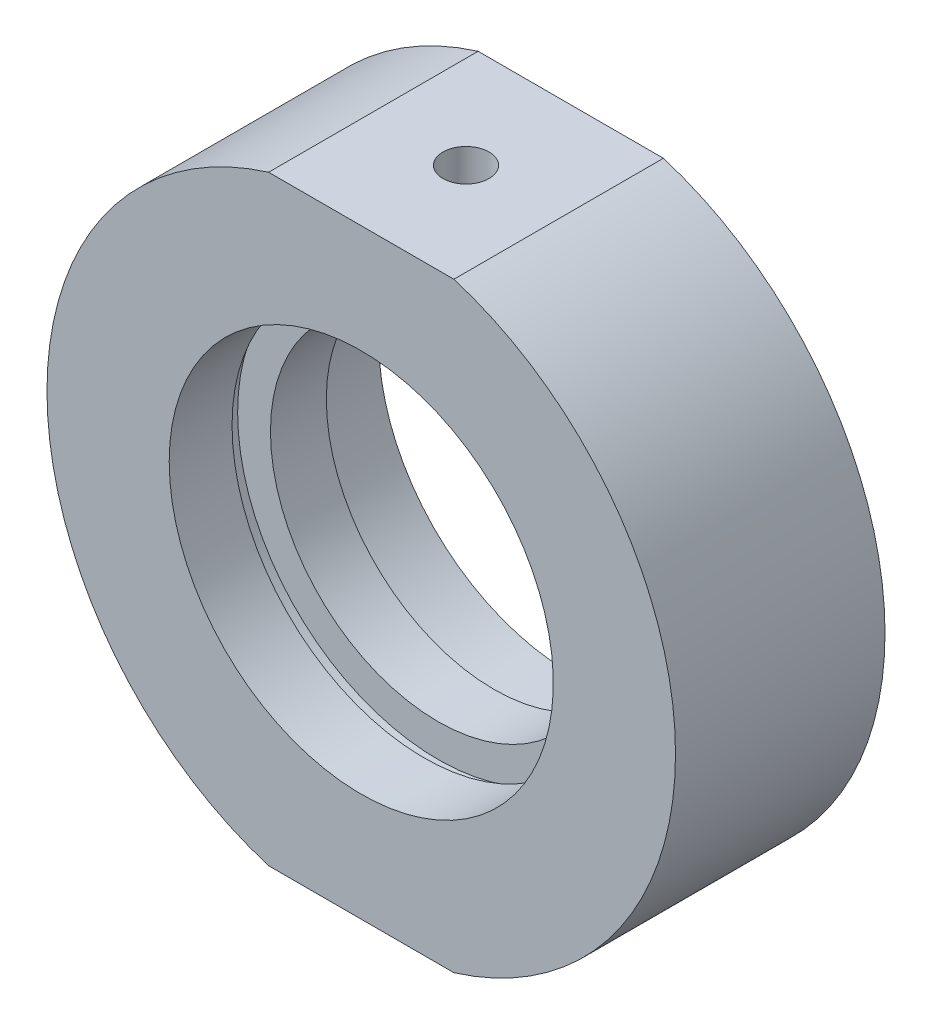
ISO-10303-21;
HEADER;
FILE_DESCRIPTION(('STEP AP214'),'2;1');
FILE_NAME('part.step','',(''),(''),'','','');
FILE_SCHEMA(('AUTOMOTIVE_DESIGN { 1 0 10303 214 1 1 1 1 }'));
ENDSEC;
DATA;
#1=APPLICATION_CONTEXT('core data for automotive mechanical design processes');
#2=APPLICATION_PROTOCOL_DEFINITION('international standard','automotive_design',2000,#1);
#3=PRODUCT_CONTEXT('',#1,'mechanical');
#4=PRODUCT('Part','Part','',(#3));
#5=PRODUCT_RELATED_PRODUCT_CATEGORY('part','',(#4));
#6=PRODUCT_DEFINITION_FORMATION('','',#4);
#7=PRODUCT_DEFINITION_CONTEXT('part definition',#1,'design');
#8=PRODUCT_DEFINITION('design','',#6,#7);
#9=PRODUCT_DEFINITION_SHAPE('','',#8);
#10=(LENGTH_UNIT() NAMED_UNIT(*) SI_UNIT(.MILLI.,.METRE.));
#11=(NAMED_UNIT(*) PLANE_ANGLE_UNIT() SI_UNIT($,.RADIAN.));
#12=(NAMED_UNIT(*) SI_UNIT($,.STERADIAN.) SOLID_ANGLE_UNIT());
#13=UNCERTAINTY_MEASURE_WITH_UNIT(LENGTH_MEASURE(1.E-05),#10,'distance_accuracy_value','');
#14=(GEOMETRIC_REPRESENTATION_CONTEXT(3) GLOBAL_UNCERTAINTY_ASSIGNED_CONTEXT((#13)) GLOBAL_UNIT_ASSIGNED_CONTEXT((#10,
#11,#12)) REPRESENTATION_CONTEXT('',''));
#15=CARTESIAN_POINT('',(0.,0.,0.));
#16=DIRECTION('',(0.,0.,1.));
#17=DIRECTION('',(1.,0.,0.));
#18=AXIS2_PLACEMENT_3D('',#15,#16,#17);
#19=CARTESIAN_POINT('',(0.,0.,-31.9390681003584));
#20=DIRECTION('',(0.,0.,-1.));
#21=DIRECTION('',(-1.,0.,0.));
#22=AXIS2_PLACEMENT_3D('',#19,#20,#21);
#23=CYLINDRICAL_SURFACE('',#22,22.5);
#24=CARTESIAN_POINT('',(0.,0.,7.49999999999999));
#25=DIRECTION('',(0.,0.,-1.));
#26=DIRECTION('',(-1.,0.,0.));
#27=AXIS2_PLACEMENT_3D('',#24,#25,#26);
#28=CIRCLE('',#27,22.5);
#29=CARTESIAN_POINT('',(6.63324958071081,21.5,7.5));
#30=VERTEX_POINT('',#29);
#31=CARTESIAN_POINT('',(6.63324958071081,-21.5,7.5));
#32=VERTEX_POINT('',#31);
#33=EDGE_CURVE('E132',#30,#32,#28,.T.);
#34=ORIENTED_EDGE('',*,*,#33,.T.);
#35=DIRECTION('',(0.,0.,-1.));
#36=VECTOR('',#35,1.);
#37=CARTESIAN_POINT('',(6.63324958071083,-21.5,-31.9390681003584));
#38=LINE('',#37,#36);
#39=CARTESIAN_POINT('',(6.6332495807108,-21.5,-7.5));
#40=VERTEX_POINT('',#39);
#41=EDGE_CURVE('E106',#32,#40,#38,.T.);
#42=ORIENTED_EDGE('',*,*,#41,.T.);
#43=CARTESIAN_POINT('',(0.,0.,-7.5));
#44=DIRECTION('',(0.,0.,-1.));
#45=DIRECTION('',(-1.,0.,0.));
#46=AXIS2_PLACEMENT_3D('',#43,#44,#45);
#47=CIRCLE('',#46,22.5);
#48=CARTESIAN_POINT('',(6.6332495807108,21.5,-7.5));
#49=VERTEX_POINT('',#48);
#50=EDGE_CURVE('E128',#49,#40,#47,.T.);
#51=ORIENTED_EDGE('',*,*,#50,.F.);
#52=DIRECTION('',(0.,0.,-1.));
#53=VECTOR('',#52,1.);
#54=CARTESIAN_POINT('',(6.63324958071083,21.5,-31.9390681003584));
#55=LINE('',#54,#53);
#56=EDGE_CURVE('E59',#49,#30,#55,.F.);
#57=ORIENTED_EDGE('',*,*,#56,.T.);
#58=EDGE_LOOP('',(#34,#42,#51,#57));
#59=FACE_BOUND('',#58,.T.);
#60=ADVANCED_FACE('F37',(#59),#23,.T.);
#61=CARTESIAN_POINT('',(12.,0.,-2.));
#62=DIRECTION('',(0.,0.,1.));
#63=DIRECTION('',(1.,0.,0.));
#64=AXIS2_PLACEMENT_3D('',#61,#62,#63);
#65=PLANE('',#64);
#66=CARTESIAN_POINT('',(0.,0.,-2.00000000000001));
#67=DIRECTION('',(0.,0.,-1.));
#68=DIRECTION('',(-1.,0.,0.));
#69=AXIS2_PLACEMENT_3D('',#66,#67,#68);
#70=CIRCLE('',#69,12.);
#71=CARTESIAN_POINT('',(-12.,0.,-2.));
#72=VERTEX_POINT('',#71);
#73=EDGE_CURVE('E150',#72,#72,#70,.T.);
#74=ORIENTED_EDGE('',*,*,#73,.F.);
#75=EDGE_LOOP('',(#74));
#76=FACE_BOUND('',#75,.T.);
#77=CARTESIAN_POINT('',(0.,0.,-2.));
#78=DIRECTION('',(0.,0.,-1.));
#79=DIRECTION('',(-1.,0.,0.));
#80=AXIS2_PLACEMENT_3D('',#77,#78,#79);
#81=CIRCLE('',#80,14.35);
#82=CARTESIAN_POINT('',(-14.35,0.,-2.));
#83=VERTEX_POINT('',#82);
#84=EDGE_CURVE('E115',#83,#83,#81,.T.);
#85=ORIENTED_EDGE('',*,*,#84,.T.);
#86=EDGE_LOOP('',(#85));
#87=FACE_BOUND('',#86,.T.);
#88=ADVANCED_FACE('F39',(#76,#87),#65,.F.);
#89=CARTESIAN_POINT('',(0.,0.,-31.9390681003584));
#90=DIRECTION('',(0.,0.,-1.));
#91=DIRECTION('',(-1.,0.,0.));
#92=AXIS2_PLACEMENT_3D('',#89,#90,#91);
#93=CYLINDRICAL_SURFACE('',#92,12.);
#94=CARTESIAN_POINT('',(0.,0.,1.99999999999999));
#95=DIRECTION('',(0.,0.,-1.));
#96=DIRECTION('',(-1.,0.,0.));
#97=AXIS2_PLACEMENT_3D('',#94,#95,#96);
#98=CIRCLE('',#97,12.);
#99=CARTESIAN_POINT('',(-12.,0.,2.));
#100=VERTEX_POINT('',#99);
#101=EDGE_CURVE('E147',#100,#100,#98,.T.);
#102=ORIENTED_EDGE('',*,*,#101,.F.);
#103=EDGE_LOOP('',(#102));
#104=FACE_BOUND('',#103,.T.);
#105=ORIENTED_EDGE('',*,*,#73,.T.);
#106=EDGE_LOOP('',(#105));
#107=FACE_BOUND('',#106,.T.);
#108=ADVANCED_FACE('F189',(#104,#107),#93,.F.);
#109=CARTESIAN_POINT('',(14.35,0.,2.));
#110=DIRECTION('',(0.,0.,-1.));
#111=DIRECTION('',(-1.,0.,0.));
#112=AXIS2_PLACEMENT_3D('',#109,#110,#111);
#113=PLANE('',#112);
#114=CARTESIAN_POINT('',(0.,0.,1.99999999999999));
#115=DIRECTION('',(0.,0.,-1.));
#116=DIRECTION('',(-1.,0.,0.));
#117=AXIS2_PLACEMENT_3D('',#114,#115,#116);
#118=CIRCLE('',#117,14.35);
#119=CARTESIAN_POINT('',(-14.35,0.,2.));
#120=VERTEX_POINT('',#119);
#121=EDGE_CURVE('E144',#120,#120,#118,.T.);
#122=ORIENTED_EDGE('',*,*,#121,.F.);
#123=EDGE_LOOP('',(#122));
#124=FACE_BOUND('',#123,.T.);
#125=ORIENTED_EDGE('',*,*,#101,.T.);
#126=EDGE_LOOP('',(#125));
#127=FACE_BOUND('',#126,.T.);
#128=ADVANCED_FACE('F214',(#124,#127),#113,.F.);
#129=CARTESIAN_POINT('',(0.,0.,-31.9390681003584));
#130=DIRECTION('',(0.,0.,-1.));
#131=DIRECTION('',(-1.,0.,0.));
#132=AXIS2_PLACEMENT_3D('',#129,#130,#131);
#133=CYLINDRICAL_SURFACE('',#132,14.35);
#134=CARTESIAN_POINT('',(0.,0.,3.));
#135=DIRECTION('',(0.,0.,-1.));
#136=DIRECTION('',(-1.,0.,0.));
#137=AXIS2_PLACEMENT_3D('',#134,#135,#136);
#138=CIRCLE('',#137,14.35);
#139=CARTESIAN_POINT('',(-14.35,0.,3.));
#140=VERTEX_POINT('',#139);
#141=EDGE_CURVE('E141',#140,#140,#138,.T.);
#142=ORIENTED_EDGE('',*,*,#141,.F.);
#143=EDGE_LOOP('',(#142));
#144=FACE_BOUND('',#143,.T.);
#145=ORIENTED_EDGE('',*,*,#121,.T.);
#146=EDGE_LOOP('',(#145));
#147=FACE_BOUND('',#146,.T.);
#148=ADVANCED_FACE('F210',(#144,#147),#133,.F.);
#149=CARTESIAN_POINT('',(14.35,0.,3.));
#150=DIRECTION('',(0.,0.,1.));
#151=DIRECTION('',(1.,0.,0.));
#152=AXIS2_PLACEMENT_3D('',#149,#150,#151);
#153=PLANE('',#152);
#154=CARTESIAN_POINT('',(0.,0.,3.));
#155=DIRECTION('',(0.,0.,-1.));
#156=DIRECTION('',(-1.,0.,0.));
#157=AXIS2_PLACEMENT_3D('',#154,#155,#156);
#158=CIRCLE('',#157,13.75);
#159=CARTESIAN_POINT('',(-13.75,0.,3.));
#160=VERTEX_POINT('',#159);
#161=EDGE_CURVE('E138',#160,#160,#158,.T.);
#162=ORIENTED_EDGE('',*,*,#161,.F.);
#163=EDGE_LOOP('',(#162));
#164=FACE_BOUND('',#163,.T.);
#165=ORIENTED_EDGE('',*,*,#141,.T.);
#166=EDGE_LOOP('',(#165));
#167=FACE_BOUND('',#166,.T.);
#168=ADVANCED_FACE('F204',(#164,#167),#153,.F.);
#169=CARTESIAN_POINT('',(0.,0.,-31.9390681003584));
#170=DIRECTION('',(0.,0.,-1.));
#171=DIRECTION('',(-1.,0.,0.));
#172=AXIS2_PLACEMENT_3D('',#169,#170,#171);
#173=CYLINDRICAL_SURFACE('',#172,13.75);
#174=CARTESIAN_POINT('',(0.,0.,7.5));
#175=DIRECTION('',(0.,0.,-1.));
#176=DIRECTION('',(-1.,0.,0.));
#177=AXIS2_PLACEMENT_3D('',#174,#175,#176);
#178=CIRCLE('',#177,13.75);
#179=CARTESIAN_POINT('',(-13.75,0.,7.5));
#180=VERTEX_POINT('',#179);
#181=EDGE_CURVE('E135',#180,#180,#178,.T.);
#182=ORIENTED_EDGE('',*,*,#181,.F.);
#183=EDGE_LOOP('',(#182));
#184=FACE_BOUND('',#183,.T.);
#185=ORIENTED_EDGE('',*,*,#161,.T.);
#186=EDGE_LOOP('',(#185));
#187=FACE_BOUND('',#186,.T.);
#188=ADVANCED_FACE('F200',(#184,#187),#173,.F.);
#189=CARTESIAN_POINT('',(22.5,0.,7.5));
#190=DIRECTION('',(0.,0.,-1.));
#191=DIRECTION('',(-1.,0.,0.));
#192=AXIS2_PLACEMENT_3D('',#189,#190,#191);
#193=PLANE('',#192);
#194=CARTESIAN_POINT('',(-6.6332495807108,-21.5,7.5));
#195=VERTEX_POINT('',#194);
#196=CARTESIAN_POINT('',(-6.6332495807108,21.5,7.5));
#197=VERTEX_POINT('',#196);
#198=EDGE_CURVE('E131',#195,#197,#28,.T.);
#199=ORIENTED_EDGE('',*,*,#198,.F.);
#200=DIRECTION('',(-1.,0.,0.));
#201=VECTOR('',#200,1.);
#202=CARTESIAN_POINT('',(-33.1519726534682,-21.5,7.5));
#203=LINE('',#202,#201);
#204=EDGE_CURVE('E103',#32,#195,#203,.T.);
#205=ORIENTED_EDGE('',*,*,#204,.F.);
#206=ORIENTED_EDGE('',*,*,#33,.F.);
#207=DIRECTION('',(1.,0.,0.));
#208=VECTOR('',#207,1.);
#209=CARTESIAN_POINT('',(-33.1519726534682,21.5,7.5));
#210=LINE('',#209,#208);
#211=EDGE_CURVE('E109',#197,#30,#210,.T.);
#212=ORIENTED_EDGE('',*,*,#211,.F.);
#213=EDGE_LOOP('',(#199,#205,#206,#212));
#214=FACE_BOUND('',#213,.T.);
#215=ORIENTED_EDGE('',*,*,#181,.T.);
#216=EDGE_LOOP('',(#215));
#217=FACE_BOUND('',#216,.T.);
#218=ADVANCED_FACE('F163',(#214,#217),#193,.F.);
#219=CARTESIAN_POINT('',(-6.6332495807108,-21.5,-7.5));
#220=VERTEX_POINT('',#219);
#221=CARTESIAN_POINT('',(-6.6332495807108,21.5,-7.5));
#222=VERTEX_POINT('',#221);
#223=EDGE_CURVE('E127',#220,#222,#47,.T.);
#224=ORIENTED_EDGE('',*,*,#223,.F.);
#225=DIRECTION('',(0.,0.,-1.));
#226=VECTOR('',#225,1.);
#227=CARTESIAN_POINT('',(-6.63324958071083,-21.5,-31.9390681003584));
#228=LINE('',#227,#226);
#229=EDGE_CURVE('E52',#220,#195,#228,.F.);
#230=ORIENTED_EDGE('',*,*,#229,.T.);
#231=ORIENTED_EDGE('',*,*,#198,.T.);
#232=DIRECTION('',(0.,0.,-1.));
#233=VECTOR('',#232,1.);
#234=CARTESIAN_POINT('',(-6.63324958071083,21.5,-31.9390681003584));
#235=LINE('',#234,#233);
#236=EDGE_CURVE('E112',#197,#222,#235,.T.);
#237=ORIENTED_EDGE('',*,*,#236,.T.);
#238=EDGE_LOOP('',(#224,#230,#231,#237));
#239=FACE_BOUND('',#238,.T.);
#240=ADVANCED_FACE('F167',(#239),#23,.T.);
#241=CARTESIAN_POINT('',(13.75,0.,-7.5));
#242=DIRECTION('',(0.,0.,1.));
#243=DIRECTION('',(1.,0.,0.));
#244=AXIS2_PLACEMENT_3D('',#241,#242,#243);
#245=PLANE('',#244);
#246=CARTESIAN_POINT('',(0.,0.,-7.5));
#247=DIRECTION('',(0.,0.,-1.));
#248=DIRECTION('',(-1.,0.,0.));
#249=AXIS2_PLACEMENT_3D('',#246,#247,#248);
#250=CIRCLE('',#249,13.75);
#251=CARTESIAN_POINT('',(-13.75,0.,-7.5));
#252=VERTEX_POINT('',#251);
#253=EDGE_CURVE('E124',#252,#252,#250,.T.);
#254=ORIENTED_EDGE('',*,*,#253,.F.);
#255=EDGE_LOOP('',(#254));
#256=FACE_BOUND('',#255,.T.);
#257=ORIENTED_EDGE('',*,*,#50,.T.);
#258=DIRECTION('',(-1.,0.,0.));
#259=VECTOR('',#258,1.);
#260=CARTESIAN_POINT('',(13.75,-21.5,-7.5));
#261=LINE('',#260,#259);
#262=EDGE_CURVE('E11',#40,#220,#261,.T.);
#263=ORIENTED_EDGE('',*,*,#262,.T.);
#264=ORIENTED_EDGE('',*,*,#223,.T.);
#265=DIRECTION('',(1.,0.,0.));
#266=VECTOR('',#265,1.);
#267=CARTESIAN_POINT('',(13.75,21.5,-7.5));
#268=LINE('',#267,#266);
#269=EDGE_CURVE('E45',#222,#49,#268,.T.);
#270=ORIENTED_EDGE('',*,*,#269,.T.);
#271=EDGE_LOOP('',(#257,#263,#264,#270));
#272=FACE_BOUND('',#271,.T.);
#273=ADVANCED_FACE('F154',(#256,#272),#245,.F.);
#274=CARTESIAN_POINT('',(0.,0.,-31.9390681003584));
#275=DIRECTION('',(0.,0.,-1.));
#276=DIRECTION('',(-1.,0.,0.));
#277=AXIS2_PLACEMENT_3D('',#274,#275,#276);
#278=CYLINDRICAL_SURFACE('',#277,13.75);
#279=CARTESIAN_POINT('',(0.,0.,-3.));
#280=DIRECTION('',(0.,0.,-1.));
#281=DIRECTION('',(-1.,0.,0.));
#282=AXIS2_PLACEMENT_3D('',#279,#280,#281);
#283=CIRCLE('',#282,13.75);
#284=CARTESIAN_POINT('',(-13.75,0.,-3.));
#285=VERTEX_POINT('',#284);
#286=EDGE_CURVE('E121',#285,#285,#283,.T.);
#287=ORIENTED_EDGE('',*,*,#286,.F.);
#288=EDGE_LOOP('',(#287));
#289=FACE_BOUND('',#288,.T.);
#290=ORIENTED_EDGE('',*,*,#253,.T.);
#291=EDGE_LOOP('',(#290));
#292=FACE_BOUND('',#291,.T.);
#293=ADVANCED_FACE('F198',(#289,#292),#278,.F.);
#294=CARTESIAN_POINT('',(14.35,0.,-3.));
#295=DIRECTION('',(0.,0.,-1.));
#296=DIRECTION('',(-1.,0.,0.));
#297=AXIS2_PLACEMENT_3D('',#294,#295,#296);
#298=PLANE('',#297);
#299=CARTESIAN_POINT('',(0.,0.,-3.));
#300=DIRECTION('',(0.,0.,-1.));
#301=DIRECTION('',(-1.,0.,0.));
#302=AXIS2_PLACEMENT_3D('',#299,#300,#301);
#303=CIRCLE('',#302,14.35);
#304=CARTESIAN_POINT('',(-14.35,0.,-3.));
#305=VERTEX_POINT('',#304);
#306=EDGE_CURVE('E118',#305,#305,#303,.T.);
#307=ORIENTED_EDGE('',*,*,#306,.F.);
#308=EDGE_LOOP('',(#307));
#309=FACE_BOUND('',#308,.T.);
#310=ORIENTED_EDGE('',*,*,#286,.T.);
#311=EDGE_LOOP('',(#310));
#312=FACE_BOUND('',#311,.T.);
#313=ADVANCED_FACE('F180',(#309,#312),#298,.F.);
#314=CARTESIAN_POINT('',(0.,0.,-31.9390681003584));
#315=DIRECTION('',(0.,0.,-1.));
#316=DIRECTION('',(-1.,0.,0.));
#317=AXIS2_PLACEMENT_3D('',#314,#315,#316);
#318=CYLINDRICAL_SURFACE('',#317,14.35);
#319=ORIENTED_EDGE('',*,*,#84,.F.);
#320=EDGE_LOOP('',(#319));
#321=FACE_BOUND('',#320,.T.);
#322=ORIENTED_EDGE('',*,*,#306,.T.);
#323=EDGE_LOOP('',(#322));
#324=FACE_BOUND('',#323,.T.);
#325=ADVANCED_FACE('F170',(#321,#324),#318,.F.);
#326=CARTESIAN_POINT('',(-33.1519726534682,21.5,-41.5));
#327=DIRECTION('',(0.,-1.,0.));
#328=DIRECTION('',(0.,0.,-1.));
#329=AXIS2_PLACEMENT_3D('',#326,#327,#328);
#330=PLANE('',#329);
#331=CARTESIAN_POINT('',(0.,21.5,0.));
#332=DIRECTION('',(0.,1.,0.));
#333=DIRECTION('',(0.,0.,1.));
#334=AXIS2_PLACEMENT_3D('',#331,#332,#333);
#335=CIRCLE('',#334,1.64999999999999);
#336=CARTESIAN_POINT('',(0.,21.5,1.64999999999999));
#337=VERTEX_POINT('',#336);
#338=EDGE_CURVE('E92',#337,#337,#335,.T.);
#339=ORIENTED_EDGE('',*,*,#338,.F.);
#340=EDGE_LOOP('',(#339));
#341=FACE_BOUND('',#340,.T.);
#342=ORIENTED_EDGE('',*,*,#211,.T.);
#343=ORIENTED_EDGE('',*,*,#56,.F.);
#344=ORIENTED_EDGE('',*,*,#269,.F.);
#345=ORIENTED_EDGE('',*,*,#236,.F.);
#346=EDGE_LOOP('',(#342,#343,#344,#345));
#347=FACE_BOUND('',#346,.T.);
#348=ADVANCED_FACE('F168',(#341,#347),#330,.F.);
#349=CARTESIAN_POINT('',(-33.1519726534682,-21.5,-41.5));
#350=DIRECTION('',(0.,1.,0.));
#351=DIRECTION('',(0.,0.,1.));
#352=AXIS2_PLACEMENT_3D('',#349,#350,#351);
#353=PLANE('',#352);
#354=CARTESIAN_POINT('',(0.,-21.5,0.));
#355=DIRECTION('',(0.,-1.,0.));
#356=DIRECTION('',(0.,0.,-1.));
#357=AXIS2_PLACEMENT_3D('',#354,#355,#356);
#358=CIRCLE('',#357,2.5);
#359=CARTESIAN_POINT('',(0.,-21.5,-2.5));
#360=VERTEX_POINT('',#359);
#361=EDGE_CURVE('E93',#360,#360,#358,.T.);
#362=ORIENTED_EDGE('',*,*,#361,.F.);
#363=EDGE_LOOP('',(#362));
#364=FACE_BOUND('',#363,.T.);
#365=ORIENTED_EDGE('',*,*,#204,.T.);
#366=ORIENTED_EDGE('',*,*,#229,.F.);
#367=ORIENTED_EDGE('',*,*,#262,.F.);
#368=ORIENTED_EDGE('',*,*,#41,.F.);
#369=EDGE_LOOP('',(#365,#366,#367,#368));
#370=FACE_BOUND('',#369,.T.);
#371=ADVANCED_FACE('F160',(#364,#370),#353,.F.);
#372=CARTESIAN_POINT('',(0.,16.,0.));
#373=DIRECTION('',(0.,1.,0.));
#374=DIRECTION('',(0.,0.,1.));
#375=AXIS2_PLACEMENT_3D('',#372,#373,#374);
#376=CONICAL_SURFACE('',#375,1.65,1.02974425867665);
#377=CARTESIAN_POINT('',(0.,15.0085799786045,0.));
#378=VERTEX_POINT('',#377);
#379=VERTEX_LOOP('',#378);
#380=FACE_BOUND('',#379,.T.);
#381=CARTESIAN_POINT('',(0.,16.,0.));
#382=DIRECTION('',(0.,1.,0.));
#383=DIRECTION('',(0.,0.,1.));
#384=AXIS2_PLACEMENT_3D('',#381,#382,#383);
#385=CIRCLE('',#384,1.65);
#386=CARTESIAN_POINT('',(0.,16.,1.65));
#387=VERTEX_POINT('',#386);
#388=EDGE_CURVE('E96',#387,#387,#385,.T.);
#389=ORIENTED_EDGE('',*,*,#388,.T.);
#390=EDGE_LOOP('',(#389));
#391=FACE_BOUND('',#390,.T.);
#392=ADVANCED_FACE('F177',(#380,#391),#376,.F.);
#393=CARTESIAN_POINT('',(0.,21.5,0.));
#394=DIRECTION('',(0.,1.,0.));
#395=DIRECTION('',(0.,0.,1.));
#396=AXIS2_PLACEMENT_3D('',#393,#394,#395);
#397=CYLINDRICAL_SURFACE('',#396,1.64999999999999);
#398=ORIENTED_EDGE('',*,*,#388,.F.);
#399=EDGE_LOOP('',(#398));
#400=FACE_BOUND('',#399,.T.);
#401=ORIENTED_EDGE('',*,*,#338,.T.);
#402=EDGE_LOOP('',(#401));
#403=FACE_BOUND('',#402,.T.);
#404=ADVANCED_FACE('F86',(#400,#403),#397,.F.);
#405=CARTESIAN_POINT('',(0.,-16.,0.));
#406=DIRECTION('',(0.,-1.,0.));
#407=DIRECTION('',(0.,0.,-1.));
#408=AXIS2_PLACEMENT_3D('',#405,#406,#407);
#409=CONICAL_SURFACE('',#408,2.5,1.02974425867665);
#410=CARTESIAN_POINT('',(0.,-14.4978484524311,0.));
#411=VERTEX_POINT('',#410);
#412=VERTEX_LOOP('',#411);
#413=FACE_BOUND('',#412,.T.);
#414=CARTESIAN_POINT('',(0.,-16.,0.));
#415=DIRECTION('',(0.,-1.,0.));
#416=DIRECTION('',(0.,0.,-1.));
#417=AXIS2_PLACEMENT_3D('',#414,#415,#416);
#418=CIRCLE('',#417,2.5);
#419=CARTESIAN_POINT('',(0.,-16.,-2.5));
#420=VERTEX_POINT('',#419);
#421=EDGE_CURVE('E90',#420,#420,#418,.T.);
#422=ORIENTED_EDGE('',*,*,#421,.T.);
#423=EDGE_LOOP('',(#422));
#424=FACE_BOUND('',#423,.T.);
#425=ADVANCED_FACE('F82',(#413,#424),#409,.F.);
#426=CARTESIAN_POINT('',(0.,-21.5,0.));
#427=DIRECTION('',(0.,-1.,0.));
#428=DIRECTION('',(0.,0.,-1.));
#429=AXIS2_PLACEMENT_3D('',#426,#427,#428);
#430=CYLINDRICAL_SURFACE('',#429,2.5);
#431=ORIENTED_EDGE('',*,*,#421,.F.);
#432=EDGE_LOOP('',(#431));
#433=FACE_BOUND('',#432,.T.);
#434=ORIENTED_EDGE('',*,*,#361,.T.);
#435=EDGE_LOOP('',(#434));
#436=FACE_BOUND('',#435,.T.);
#437=ADVANCED_FACE('F85',(#433,#436),#430,.F.);
#438=CLOSED_SHELL('',(#60,#88,#108,#128,#148,#168,#188,#218,#240,#273,#293,#313,#325,#348,#371,
#392,#404,#425,#437));
#439=MANIFOLD_SOLID_BREP('B2',#438);
#440=ADVANCED_BREP_SHAPE_REPRESENTATION('',(#18,#439),#14);
#441=SHAPE_DEFINITION_REPRESENTATION(#9,#440);
ENDSEC;
END-ISO-10303-21;
